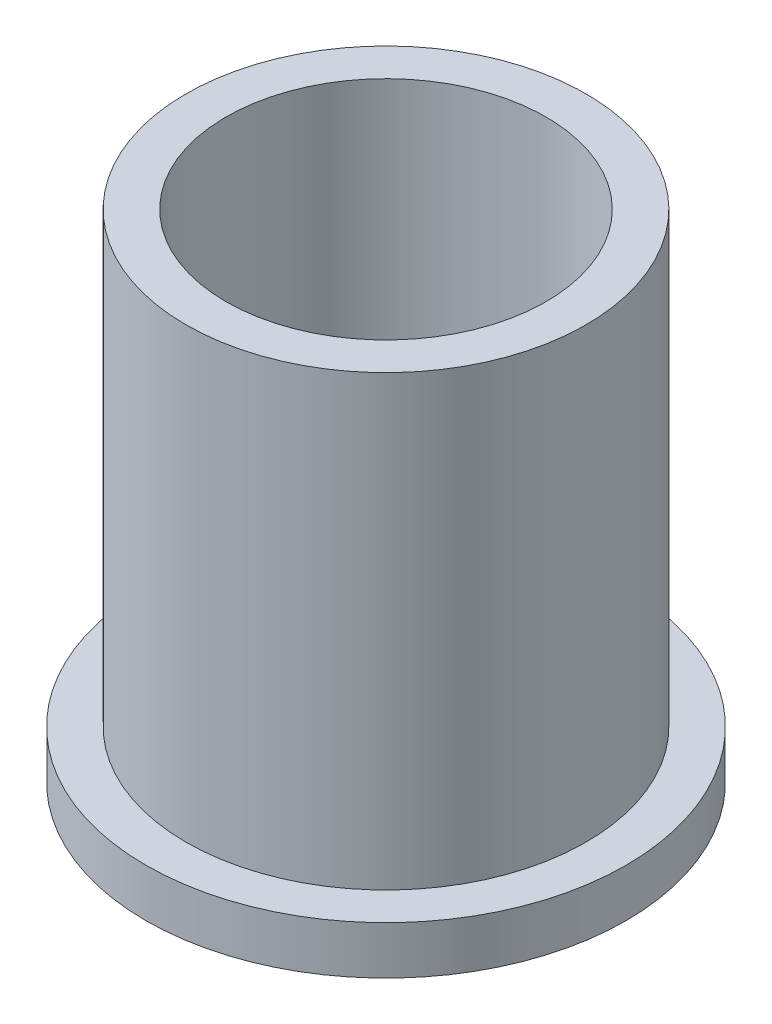
ISO-10303-21;
HEADER;
FILE_DESCRIPTION(('STEP AP214'),'2;1');
FILE_NAME('part.step','',(''),(''),'','','');
FILE_SCHEMA(('AUTOMOTIVE_DESIGN { 1 0 10303 214 1 1 1 1 }'));
ENDSEC;
DATA;
#1=APPLICATION_CONTEXT('core data for automotive mechanical design processes');
#2=APPLICATION_PROTOCOL_DEFINITION('international standard','automotive_design',2000,#1);
#3=PRODUCT_CONTEXT('',#1,'mechanical');
#4=PRODUCT('Part','Part','',(#3));
#5=PRODUCT_RELATED_PRODUCT_CATEGORY('part','',(#4));
#6=PRODUCT_DEFINITION_FORMATION('','',#4);
#7=PRODUCT_DEFINITION_CONTEXT('part definition',#1,'design');
#8=PRODUCT_DEFINITION('design','',#6,#7);
#9=PRODUCT_DEFINITION_SHAPE('','',#8);
#10=(LENGTH_UNIT() NAMED_UNIT(*) SI_UNIT(.MILLI.,.METRE.));
#11=(NAMED_UNIT(*) PLANE_ANGLE_UNIT() SI_UNIT($,.RADIAN.));
#12=(NAMED_UNIT(*) SI_UNIT($,.STERADIAN.) SOLID_ANGLE_UNIT());
#13=UNCERTAINTY_MEASURE_WITH_UNIT(LENGTH_MEASURE(1.E-05),#10,'distance_accuracy_value','');
#14=(GEOMETRIC_REPRESENTATION_CONTEXT(3) GLOBAL_UNCERTAINTY_ASSIGNED_CONTEXT((#13)) GLOBAL_UNIT_ASSIGNED_CONTEXT((#10,
#11,#12)) REPRESENTATION_CONTEXT('',''));
#15=CARTESIAN_POINT('',(0.,0.,0.));
#16=DIRECTION('',(0.,0.,1.));
#17=DIRECTION('',(1.,0.,0.));
#18=AXIS2_PLACEMENT_3D('',#15,#16,#17);
#19=CARTESIAN_POINT('',(0.,3.,0.));
#20=DIRECTION('',(0.,-1.,0.));
#21=DIRECTION('',(0.,0.,-1.));
#22=AXIS2_PLACEMENT_3D('',#19,#20,#21);
#23=CYLINDRICAL_SURFACE('',#22,15.);
#24=CARTESIAN_POINT('',(0.,3.,0.));
#25=DIRECTION('',(0.,1.,0.));
#26=DIRECTION('',(0.,0.,1.));
#27=AXIS2_PLACEMENT_3D('',#24,#25,#26);
#28=CIRCLE('',#27,15.);
#29=CARTESIAN_POINT('',(0.,3.,15.));
#30=VERTEX_POINT('',#29);
#31=EDGE_CURVE('E10',#30,#30,#28,.T.);
#32=ORIENTED_EDGE('',*,*,#31,.F.);
#33=EDGE_LOOP('',(#32));
#34=FACE_BOUND('',#33,.T.);
#35=CARTESIAN_POINT('',(0.,0.,0.));
#36=DIRECTION('',(0.,1.,0.));
#37=DIRECTION('',(0.,0.,1.));
#38=AXIS2_PLACEMENT_3D('',#35,#36,#37);
#39=CIRCLE('',#38,15.);
#40=CARTESIAN_POINT('',(0.,0.,15.));
#41=VERTEX_POINT('',#40);
#42=EDGE_CURVE('E37',#41,#41,#39,.T.);
#43=ORIENTED_EDGE('',*,*,#42,.T.);
#44=EDGE_LOOP('',(#43));
#45=FACE_BOUND('',#44,.T.);
#46=ADVANCED_FACE('F34',(#34,#45),#23,.T.);
#47=CARTESIAN_POINT('',(0.,3.,0.));
#48=DIRECTION('',(0.,1.,0.));
#49=DIRECTION('',(0.,0.,1.));
#50=AXIS2_PLACEMENT_3D('',#47,#48,#49);
#51=PLANE('',#50);
#52=CARTESIAN_POINT('',(0.,3.,0.));
#53=DIRECTION('',(0.,1.,0.));
#54=DIRECTION('',(0.,0.,1.));
#55=AXIS2_PLACEMENT_3D('',#52,#53,#54);
#56=CIRCLE('',#55,12.5);
#57=CARTESIAN_POINT('',(0.,3.,12.5));
#58=VERTEX_POINT('',#57);
#59=EDGE_CURVE('E44',#58,#58,#56,.F.);
#60=ORIENTED_EDGE('',*,*,#59,.T.);
#61=EDGE_LOOP('',(#60));
#62=FACE_BOUND('',#61,.T.);
#63=ORIENTED_EDGE('',*,*,#31,.T.);
#64=EDGE_LOOP('',(#63));
#65=FACE_BOUND('',#64,.T.);
#66=ADVANCED_FACE('F75',(#62,#65),#51,.T.);
#67=CARTESIAN_POINT('',(0.,0.,0.));
#68=DIRECTION('',(0.,1.,0.));
#69=DIRECTION('',(0.,0.,1.));
#70=AXIS2_PLACEMENT_3D('',#67,#68,#69);
#71=PLANE('',#70);
#72=CARTESIAN_POINT('',(0.,0.,0.));
#73=DIRECTION('',(0.,1.,0.));
#74=DIRECTION('',(0.,0.,1.));
#75=AXIS2_PLACEMENT_3D('',#72,#73,#74);
#76=CIRCLE('',#75,10.);
#77=CARTESIAN_POINT('',(0.,0.,10.));
#78=VERTEX_POINT('',#77);
#79=EDGE_CURVE('E51',#78,#78,#76,.F.);
#80=ORIENTED_EDGE('',*,*,#79,.F.);
#81=EDGE_LOOP('',(#80));
#82=FACE_BOUND('',#81,.T.);
#83=ORIENTED_EDGE('',*,*,#42,.F.);
#84=EDGE_LOOP('',(#83));
#85=FACE_BOUND('',#84,.T.);
#86=ADVANCED_FACE('F69',(#82,#85),#71,.F.);
#87=CARTESIAN_POINT('',(0.,31.,0.));
#88=DIRECTION('',(0.,-1.,0.));
#89=DIRECTION('',(0.,0.,-1.));
#90=AXIS2_PLACEMENT_3D('',#87,#88,#89);
#91=CYLINDRICAL_SURFACE('',#90,12.5);
#92=ORIENTED_EDGE('',*,*,#59,.F.);
#93=EDGE_LOOP('',(#92));
#94=FACE_BOUND('',#93,.T.);
#95=CARTESIAN_POINT('',(0.,31.,0.));
#96=DIRECTION('',(0.,1.,0.));
#97=DIRECTION('',(0.,0.,1.));
#98=AXIS2_PLACEMENT_3D('',#95,#96,#97);
#99=CIRCLE('',#98,12.5);
#100=CARTESIAN_POINT('',(0.,31.,12.5));
#101=VERTEX_POINT('',#100);
#102=EDGE_CURVE('E48',#101,#101,#99,.T.);
#103=ORIENTED_EDGE('',*,*,#102,.F.);
#104=EDGE_LOOP('',(#103));
#105=FACE_BOUND('',#104,.T.);
#106=ADVANCED_FACE('F64',(#94,#105),#91,.T.);
#107=CARTESIAN_POINT('',(0.,31.,0.));
#108=DIRECTION('',(0.,1.,0.));
#109=DIRECTION('',(0.,0.,1.));
#110=AXIS2_PLACEMENT_3D('',#107,#108,#109);
#111=PLANE('',#110);
#112=CARTESIAN_POINT('',(0.,31.,0.));
#113=DIRECTION('',(0.,1.,0.));
#114=DIRECTION('',(0.,0.,1.));
#115=AXIS2_PLACEMENT_3D('',#112,#113,#114);
#116=CIRCLE('',#115,10.);
#117=CARTESIAN_POINT('',(0.,31.,10.));
#118=VERTEX_POINT('',#117);
#119=EDGE_CURVE('E54',#118,#118,#116,.T.);
#120=ORIENTED_EDGE('',*,*,#119,.F.);
#121=EDGE_LOOP('',(#120));
#122=FACE_BOUND('',#121,.T.);
#123=ORIENTED_EDGE('',*,*,#102,.T.);
#124=EDGE_LOOP('',(#123));
#125=FACE_BOUND('',#124,.T.);
#126=ADVANCED_FACE('F61',(#122,#125),#111,.T.);
#127=CARTESIAN_POINT('',(0.,31.,0.));
#128=DIRECTION('',(0.,-1.,0.));
#129=DIRECTION('',(0.,0.,-1.));
#130=AXIS2_PLACEMENT_3D('',#127,#128,#129);
#131=CYLINDRICAL_SURFACE('',#130,10.);
#132=ORIENTED_EDGE('',*,*,#119,.T.);
#133=EDGE_LOOP('',(#132));
#134=FACE_BOUND('',#133,.T.);
#135=ORIENTED_EDGE('',*,*,#79,.T.);
#136=EDGE_LOOP('',(#135));
#137=FACE_BOUND('',#136,.T.);
#138=ADVANCED_FACE('F58',(#134,#137),#131,.F.);
#139=CLOSED_SHELL('',(#46,#66,#86,#106,#126,#138));
#140=MANIFOLD_SOLID_BREP('B2',#139);
#141=ADVANCED_BREP_SHAPE_REPRESENTATION('',(#18,#140),#14);
#142=SHAPE_DEFINITION_REPRESENTATION(#9,#141);
ENDSEC;
END-ISO-10303-21;
